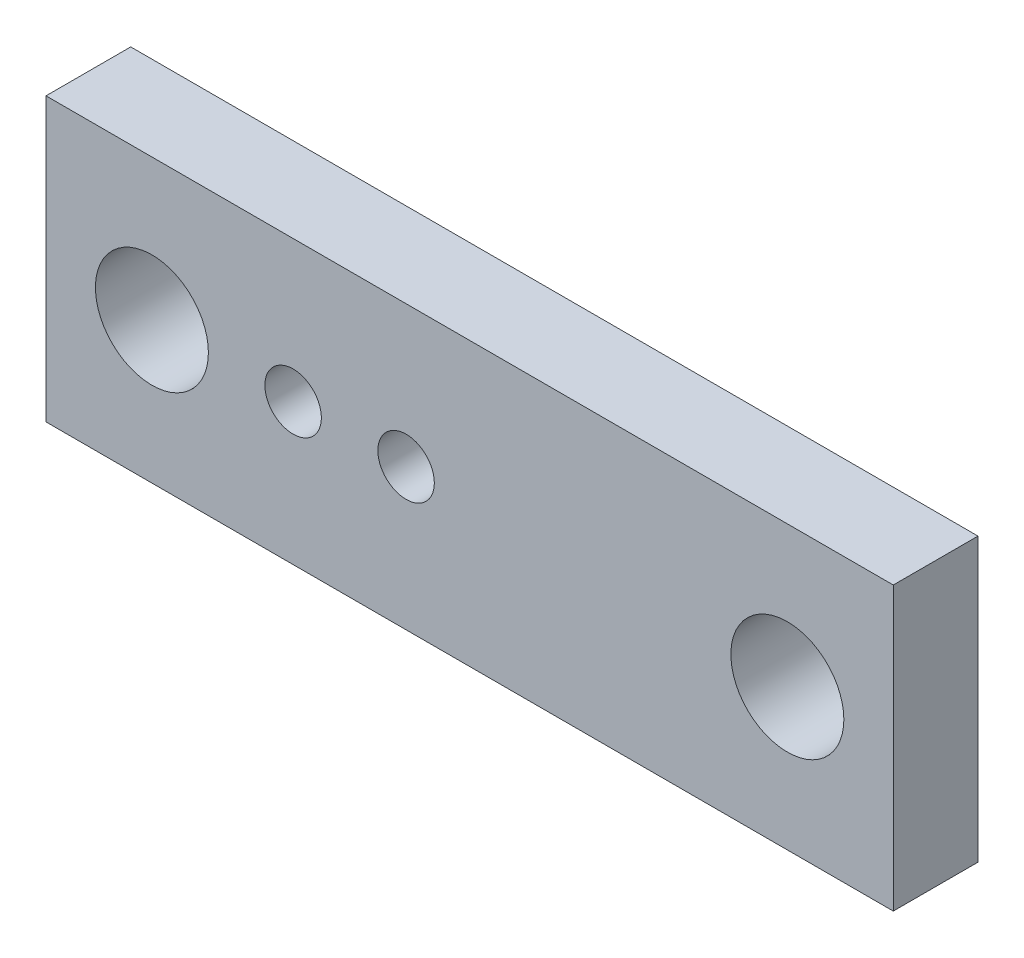
ISO-10303-21;
HEADER;
FILE_DESCRIPTION(('STEP AP214'),'2;1');
FILE_NAME('part.step','',(''),(''),'','','');
FILE_SCHEMA(('AUTOMOTIVE_DESIGN { 1 0 10303 214 1 1 1 1 }'));
ENDSEC;
DATA;
#1=APPLICATION_CONTEXT('core data for automotive mechanical design processes');
#2=APPLICATION_PROTOCOL_DEFINITION('international standard','automotive_design',2000,#1);
#3=PRODUCT_CONTEXT('',#1,'mechanical');
#4=PRODUCT('Part','Part','',(#3));
#5=PRODUCT_RELATED_PRODUCT_CATEGORY('part','',(#4));
#6=PRODUCT_DEFINITION_FORMATION('','',#4);
#7=PRODUCT_DEFINITION_CONTEXT('part definition',#1,'design');
#8=PRODUCT_DEFINITION('design','',#6,#7);
#9=PRODUCT_DEFINITION_SHAPE('','',#8);
#10=(LENGTH_UNIT() NAMED_UNIT(*) SI_UNIT(.MILLI.,.METRE.));
#11=(NAMED_UNIT(*) PLANE_ANGLE_UNIT() SI_UNIT($,.RADIAN.));
#12=(NAMED_UNIT(*) SI_UNIT($,.STERADIAN.) SOLID_ANGLE_UNIT());
#13=UNCERTAINTY_MEASURE_WITH_UNIT(LENGTH_MEASURE(1.E-05),#10,'distance_accuracy_value','');
#14=(GEOMETRIC_REPRESENTATION_CONTEXT(3) GLOBAL_UNCERTAINTY_ASSIGNED_CONTEXT((#13)) GLOBAL_UNIT_ASSIGNED_CONTEXT((#10,
#11,#12)) REPRESENTATION_CONTEXT('',''));
#15=CARTESIAN_POINT('',(0.,0.,0.));
#16=DIRECTION('',(0.,0.,1.));
#17=DIRECTION('',(1.,0.,0.));
#18=AXIS2_PLACEMENT_3D('',#15,#16,#17);
#19=CARTESIAN_POINT('',(17.5,10.,6.));
#20=DIRECTION('',(0.,0.,-1.));
#21=DIRECTION('',(-1.,0.,0.));
#22=AXIS2_PLACEMENT_3D('',#19,#20,#21);
#23=CYLINDRICAL_SURFACE('',#22,2.);
#24=CARTESIAN_POINT('',(17.5,10.,6.));
#25=DIRECTION('',(0.,0.,1.));
#26=DIRECTION('',(1.,0.,0.));
#27=AXIS2_PLACEMENT_3D('',#24,#25,#26);
#28=CIRCLE('',#27,2.);
#29=CARTESIAN_POINT('',(19.5,10.,6.));
#30=VERTEX_POINT('',#29);
#31=EDGE_CURVE('E158',#30,#30,#28,.T.);
#32=ORIENTED_EDGE('',*,*,#31,.T.);
#33=EDGE_LOOP('',(#32));
#34=FACE_BOUND('',#33,.T.);
#35=CARTESIAN_POINT('',(17.5,10.,3.));
#36=DIRECTION('',(0.,0.,-1.));
#37=DIRECTION('',(-1.,0.,0.));
#38=AXIS2_PLACEMENT_3D('',#35,#36,#37);
#39=CIRCLE('',#38,2.);
#40=CARTESIAN_POINT('',(15.5,10.,3.));
#41=VERTEX_POINT('',#40);
#42=EDGE_CURVE('E147',#41,#41,#39,.T.);
#43=ORIENTED_EDGE('',*,*,#42,.T.);
#44=EDGE_LOOP('',(#43));
#45=FACE_BOUND('',#44,.T.);
#46=ADVANCED_FACE('F35',(#34,#45),#23,.F.);
#47=CARTESIAN_POINT('',(25.5,10.,6.));
#48=DIRECTION('',(0.,0.,-1.));
#49=DIRECTION('',(-1.,0.,0.));
#50=AXIS2_PLACEMENT_3D('',#47,#48,#49);
#51=CYLINDRICAL_SURFACE('',#50,2.);
#52=CARTESIAN_POINT('',(25.5,10.,6.));
#53=DIRECTION('',(0.,0.,1.));
#54=DIRECTION('',(1.,0.,0.));
#55=AXIS2_PLACEMENT_3D('',#52,#53,#54);
#56=CIRCLE('',#55,2.);
#57=CARTESIAN_POINT('',(27.5,10.,6.));
#58=VERTEX_POINT('',#57);
#59=EDGE_CURVE('E154',#58,#58,#56,.T.);
#60=ORIENTED_EDGE('',*,*,#59,.T.);
#61=EDGE_LOOP('',(#60));
#62=FACE_BOUND('',#61,.T.);
#63=CARTESIAN_POINT('',(25.5,10.,3.));
#64=DIRECTION('',(0.,0.,-1.));
#65=DIRECTION('',(-1.,0.,0.));
#66=AXIS2_PLACEMENT_3D('',#63,#64,#65);
#67=CIRCLE('',#66,2.);
#68=CARTESIAN_POINT('',(23.5,10.,3.));
#69=VERTEX_POINT('',#68);
#70=EDGE_CURVE('E39',#69,#69,#67,.T.);
#71=ORIENTED_EDGE('',*,*,#70,.T.);
#72=EDGE_LOOP('',(#71));
#73=FACE_BOUND('',#72,.T.);
#74=ADVANCED_FACE('F204',(#62,#73),#51,.F.);
#75=CARTESIAN_POINT('',(0.,0.,6.));
#76=DIRECTION('',(0.,1.,0.));
#77=DIRECTION('',(0.,0.,1.));
#78=AXIS2_PLACEMENT_3D('',#75,#76,#77);
#79=PLANE('',#78);
#80=DIRECTION('',(1.,0.,0.));
#81=VECTOR('',#80,1.);
#82=CARTESIAN_POINT('',(0.,0.,0.));
#83=LINE('',#82,#81);
#84=CARTESIAN_POINT('',(0.,0.,0.));
#85=VERTEX_POINT('',#84);
#86=CARTESIAN_POINT('',(60.,0.,0.));
#87=VERTEX_POINT('',#86);
#88=EDGE_CURVE('E177',#85,#87,#83,.T.);
#89=ORIENTED_EDGE('',*,*,#88,.T.);
#90=DIRECTION('',(0.,0.,-1.));
#91=VECTOR('',#90,1.);
#92=CARTESIAN_POINT('',(60.,0.,6.));
#93=LINE('',#92,#91);
#94=CARTESIAN_POINT('',(60.,0.,6.));
#95=VERTEX_POINT('',#94);
#96=EDGE_CURVE('E11',#95,#87,#93,.T.);
#97=ORIENTED_EDGE('',*,*,#96,.F.);
#98=DIRECTION('',(1.,0.,0.));
#99=VECTOR('',#98,1.);
#100=CARTESIAN_POINT('',(0.,0.,6.));
#101=LINE('',#100,#99);
#102=CARTESIAN_POINT('',(0.,0.,6.));
#103=VERTEX_POINT('',#102);
#104=EDGE_CURVE('E164',#103,#95,#101,.T.);
#105=ORIENTED_EDGE('',*,*,#104,.F.);
#106=DIRECTION('',(0.,0.,-1.));
#107=VECTOR('',#106,1.);
#108=CARTESIAN_POINT('',(0.,0.,6.));
#109=LINE('',#108,#107);
#110=EDGE_CURVE('E60',#103,#85,#109,.T.);
#111=ORIENTED_EDGE('',*,*,#110,.T.);
#112=EDGE_LOOP('',(#89,#97,#105,#111));
#113=FACE_BOUND('',#112,.T.);
#114=ADVANCED_FACE('F202',(#113),#79,.F.);
#115=CARTESIAN_POINT('',(60.,0.,6.));
#116=DIRECTION('',(-1.,0.,0.));
#117=DIRECTION('',(0.,0.,1.));
#118=AXIS2_PLACEMENT_3D('',#115,#116,#117);
#119=PLANE('',#118);
#120=DIRECTION('',(0.,1.,0.));
#121=VECTOR('',#120,1.);
#122=CARTESIAN_POINT('',(60.,0.,0.));
#123=LINE('',#122,#121);
#124=CARTESIAN_POINT('',(60.,20.,0.));
#125=VERTEX_POINT('',#124);
#126=EDGE_CURVE('E179',#87,#125,#123,.T.);
#127=ORIENTED_EDGE('',*,*,#126,.T.);
#128=DIRECTION('',(0.,0.,-1.));
#129=VECTOR('',#128,1.);
#130=CARTESIAN_POINT('',(60.,20.,6.));
#131=LINE('',#130,#129);
#132=CARTESIAN_POINT('',(60.,20.,6.));
#133=VERTEX_POINT('',#132);
#134=EDGE_CURVE('E44',#133,#125,#131,.T.);
#135=ORIENTED_EDGE('',*,*,#134,.F.);
#136=DIRECTION('',(0.,1.,0.));
#137=VECTOR('',#136,1.);
#138=CARTESIAN_POINT('',(60.,0.,6.));
#139=LINE('',#138,#137);
#140=EDGE_CURVE('E86',#95,#133,#139,.T.);
#141=ORIENTED_EDGE('',*,*,#140,.F.);
#142=ORIENTED_EDGE('',*,*,#96,.T.);
#143=EDGE_LOOP('',(#127,#135,#141,#142));
#144=FACE_BOUND('',#143,.T.);
#145=ADVANCED_FACE('F194',(#144),#119,.F.);
#146=CARTESIAN_POINT('',(0.,20.,6.));
#147=DIRECTION('',(0.,1.,0.));
#148=DIRECTION('',(0.,0.,1.));
#149=AXIS2_PLACEMENT_3D('',#146,#147,#148);
#150=PLANE('',#149);
#151=DIRECTION('',(1.,0.,0.));
#152=VECTOR('',#151,1.);
#153=CARTESIAN_POINT('',(0.,20.,0.));
#154=LINE('',#153,#152);
#155=CARTESIAN_POINT('',(0.,20.,0.));
#156=VERTEX_POINT('',#155);
#157=EDGE_CURVE('E182',#156,#125,#154,.T.);
#158=ORIENTED_EDGE('',*,*,#157,.F.);
#159=DIRECTION('',(0.,0.,-1.));
#160=VECTOR('',#159,1.);
#161=CARTESIAN_POINT('',(0.,20.,6.));
#162=LINE('',#161,#160);
#163=CARTESIAN_POINT('',(0.,20.,6.));
#164=VERTEX_POINT('',#163);
#165=EDGE_CURVE('E188',#164,#156,#162,.T.);
#166=ORIENTED_EDGE('',*,*,#165,.F.);
#167=DIRECTION('',(1.,0.,0.));
#168=VECTOR('',#167,1.);
#169=CARTESIAN_POINT('',(0.,20.,6.));
#170=LINE('',#169,#168);
#171=EDGE_CURVE('E167',#164,#133,#170,.T.);
#172=ORIENTED_EDGE('',*,*,#171,.T.);
#173=ORIENTED_EDGE('',*,*,#134,.T.);
#174=EDGE_LOOP('',(#158,#166,#172,#173));
#175=FACE_BOUND('',#174,.T.);
#176=ADVANCED_FACE('F192',(#175),#150,.T.);
#177=CARTESIAN_POINT('',(7.5,10.,6.));
#178=DIRECTION('',(0.,0.,-1.));
#179=DIRECTION('',(-1.,0.,0.));
#180=AXIS2_PLACEMENT_3D('',#177,#178,#179);
#181=CYLINDRICAL_SURFACE('',#180,4.);
#182=CARTESIAN_POINT('',(7.5,10.,6.));
#183=DIRECTION('',(0.,0.,1.));
#184=DIRECTION('',(1.,0.,0.));
#185=AXIS2_PLACEMENT_3D('',#182,#183,#184);
#186=CIRCLE('',#185,4.);
#187=CARTESIAN_POINT('',(11.5,10.,6.));
#188=VERTEX_POINT('',#187);
#189=EDGE_CURVE('E161',#188,#188,#186,.T.);
#190=ORIENTED_EDGE('',*,*,#189,.T.);
#191=EDGE_LOOP('',(#190));
#192=FACE_BOUND('',#191,.T.);
#193=CARTESIAN_POINT('',(7.5,10.,0.));
#194=DIRECTION('',(0.,0.,1.));
#195=DIRECTION('',(1.,0.,0.));
#196=AXIS2_PLACEMENT_3D('',#193,#194,#195);
#197=CIRCLE('',#196,4.);
#198=CARTESIAN_POINT('',(11.5,10.,0.));
#199=VERTEX_POINT('',#198);
#200=EDGE_CURVE('E174',#199,#199,#197,.T.);
#201=ORIENTED_EDGE('',*,*,#200,.F.);
#202=EDGE_LOOP('',(#201));
#203=FACE_BOUND('',#202,.T.);
#204=ADVANCED_FACE('F219',(#192,#203),#181,.F.);
#205=CARTESIAN_POINT('',(52.5,10.,6.));
#206=DIRECTION('',(0.,0.,-1.));
#207=DIRECTION('',(-1.,0.,0.));
#208=AXIS2_PLACEMENT_3D('',#205,#206,#207);
#209=CYLINDRICAL_SURFACE('',#208,4.00000000000001);
#210=CARTESIAN_POINT('',(52.5,10.,6.));
#211=DIRECTION('',(0.,0.,1.));
#212=DIRECTION('',(1.,0.,0.));
#213=AXIS2_PLACEMENT_3D('',#210,#211,#212);
#214=CIRCLE('',#213,4.00000000000001);
#215=CARTESIAN_POINT('',(56.5,10.,6.));
#216=VERTEX_POINT('',#215);
#217=EDGE_CURVE('E151',#216,#216,#214,.T.);
#218=ORIENTED_EDGE('',*,*,#217,.T.);
#219=EDGE_LOOP('',(#218));
#220=FACE_BOUND('',#219,.T.);
#221=CARTESIAN_POINT('',(52.5,10.,0.));
#222=DIRECTION('',(0.,0.,1.));
#223=DIRECTION('',(1.,0.,0.));
#224=AXIS2_PLACEMENT_3D('',#221,#222,#223);
#225=CIRCLE('',#224,4.00000000000001);
#226=CARTESIAN_POINT('',(56.5,10.,0.));
#227=VERTEX_POINT('',#226);
#228=EDGE_CURVE('E150',#227,#227,#225,.T.);
#229=ORIENTED_EDGE('',*,*,#228,.F.);
#230=EDGE_LOOP('',(#229));
#231=FACE_BOUND('',#230,.T.);
#232=ADVANCED_FACE('F37',(#220,#231),#209,.F.);
#233=CARTESIAN_POINT('',(0.,0.,6.));
#234=DIRECTION('',(-1.,0.,0.));
#235=DIRECTION('',(0.,0.,1.));
#236=AXIS2_PLACEMENT_3D('',#233,#234,#235);
#237=PLANE('',#236);
#238=DIRECTION('',(0.,1.,0.));
#239=VECTOR('',#238,1.);
#240=CARTESIAN_POINT('',(0.,0.,0.));
#241=LINE('',#240,#239);
#242=EDGE_CURVE('E155',#85,#156,#241,.T.);
#243=ORIENTED_EDGE('',*,*,#242,.F.);
#244=ORIENTED_EDGE('',*,*,#110,.F.);
#245=DIRECTION('',(0.,1.,0.));
#246=VECTOR('',#245,1.);
#247=CARTESIAN_POINT('',(0.,0.,6.));
#248=LINE('',#247,#246);
#249=EDGE_CURVE('E170',#103,#164,#248,.T.);
#250=ORIENTED_EDGE('',*,*,#249,.T.);
#251=ORIENTED_EDGE('',*,*,#165,.T.);
#252=EDGE_LOOP('',(#243,#244,#250,#251));
#253=FACE_BOUND('',#252,.T.);
#254=ADVANCED_FACE('F198',(#253),#237,.T.);
#255=CARTESIAN_POINT('',(0.,0.,6.));
#256=DIRECTION('',(0.,0.,1.));
#257=DIRECTION('',(1.,0.,0.));
#258=AXIS2_PLACEMENT_3D('',#255,#256,#257);
#259=PLANE('',#258);
#260=ORIENTED_EDGE('',*,*,#217,.F.);
#261=EDGE_LOOP('',(#260));
#262=FACE_BOUND('',#261,.T.);
#263=ORIENTED_EDGE('',*,*,#59,.F.);
#264=EDGE_LOOP('',(#263));
#265=FACE_BOUND('',#264,.T.);
#266=ORIENTED_EDGE('',*,*,#31,.F.);
#267=EDGE_LOOP('',(#266));
#268=FACE_BOUND('',#267,.T.);
#269=ORIENTED_EDGE('',*,*,#189,.F.);
#270=EDGE_LOOP('',(#269));
#271=FACE_BOUND('',#270,.T.);
#272=ORIENTED_EDGE('',*,*,#104,.T.);
#273=ORIENTED_EDGE('',*,*,#140,.T.);
#274=ORIENTED_EDGE('',*,*,#171,.F.);
#275=ORIENTED_EDGE('',*,*,#249,.F.);
#276=EDGE_LOOP('',(#272,#273,#274,#275));
#277=FACE_BOUND('',#276,.T.);
#278=ADVANCED_FACE('F201',(#262,#265,#268,#271,#277),#259,.T.);
#279=CARTESIAN_POINT('',(0.,0.,0.));
#280=DIRECTION('',(0.,0.,1.));
#281=DIRECTION('',(1.,0.,0.));
#282=AXIS2_PLACEMENT_3D('',#279,#280,#281);
#283=PLANE('',#282);
#284=DIRECTION('',(-1.,0.,0.));
#285=VECTOR('',#284,1.);
#286=CARTESIAN_POINT('',(25.5,7.25,0.));
#287=LINE('',#286,#285);
#288=CARTESIAN_POINT('',(25.5,7.25,0.));
#289=VERTEX_POINT('',#288);
#290=CARTESIAN_POINT('',(17.5,7.25,0.));
#291=VERTEX_POINT('',#290);
#292=EDGE_CURVE('E138',#289,#291,#287,.T.);
#293=ORIENTED_EDGE('',*,*,#292,.F.);
#294=CARTESIAN_POINT('',(25.5,10.,0.));
#295=DIRECTION('',(0.,0.,-1.));
#296=DIRECTION('',(-1.,0.,0.));
#297=AXIS2_PLACEMENT_3D('',#294,#295,#296);
#298=CIRCLE('',#297,2.75);
#299=CARTESIAN_POINT('',(25.5,12.75,0.));
#300=VERTEX_POINT('',#299);
#301=EDGE_CURVE('E51',#300,#289,#298,.T.);
#302=ORIENTED_EDGE('',*,*,#301,.F.);
#303=DIRECTION('',(1.,0.,0.));
#304=VECTOR('',#303,1.);
#305=CARTESIAN_POINT('',(25.5,12.75,0.));
#306=LINE('',#305,#304);
#307=CARTESIAN_POINT('',(17.5,12.75,0.));
#308=VERTEX_POINT('',#307);
#309=EDGE_CURVE('E129',#308,#300,#306,.T.);
#310=ORIENTED_EDGE('',*,*,#309,.F.);
#311=CARTESIAN_POINT('',(17.5,10.,0.));
#312=DIRECTION('',(0.,0.,-1.));
#313=DIRECTION('',(-1.,0.,0.));
#314=AXIS2_PLACEMENT_3D('',#311,#312,#313);
#315=CIRCLE('',#314,2.75);
#316=EDGE_CURVE('E132',#291,#308,#315,.T.);
#317=ORIENTED_EDGE('',*,*,#316,.F.);
#318=EDGE_LOOP('',(#293,#302,#310,#317));
#319=FACE_BOUND('',#318,.T.);
#320=ORIENTED_EDGE('',*,*,#228,.T.);
#321=EDGE_LOOP('',(#320));
#322=FACE_BOUND('',#321,.T.);
#323=ORIENTED_EDGE('',*,*,#200,.T.);
#324=EDGE_LOOP('',(#323));
#325=FACE_BOUND('',#324,.T.);
#326=ORIENTED_EDGE('',*,*,#88,.F.);
#327=ORIENTED_EDGE('',*,*,#242,.T.);
#328=ORIENTED_EDGE('',*,*,#157,.T.);
#329=ORIENTED_EDGE('',*,*,#126,.F.);
#330=EDGE_LOOP('',(#326,#327,#328,#329));
#331=FACE_BOUND('',#330,.T.);
#332=ADVANCED_FACE('F197',(#319,#322,#325,#331),#283,.F.);
#333=CARTESIAN_POINT('',(25.5,10.,3.));
#334=DIRECTION('',(0.,0.,-1.));
#335=DIRECTION('',(-1.,0.,0.));
#336=AXIS2_PLACEMENT_3D('',#333,#334,#335);
#337=CYLINDRICAL_SURFACE('',#336,2.75);
#338=ORIENTED_EDGE('',*,*,#301,.T.);
#339=DIRECTION('',(0.,0.,-1.));
#340=VECTOR('',#339,1.);
#341=CARTESIAN_POINT('',(25.5,7.25,3.));
#342=LINE('',#341,#340);
#343=CARTESIAN_POINT('',(25.5,7.25,3.));
#344=VERTEX_POINT('',#343);
#345=EDGE_CURVE('E107',#344,#289,#342,.T.);
#346=ORIENTED_EDGE('',*,*,#345,.F.);
#347=CARTESIAN_POINT('',(25.5,10.,3.));
#348=DIRECTION('',(0.,0.,-1.));
#349=DIRECTION('',(-1.,0.,0.));
#350=AXIS2_PLACEMENT_3D('',#347,#348,#349);
#351=CIRCLE('',#350,2.75);
#352=CARTESIAN_POINT('',(25.5,12.75,3.));
#353=VERTEX_POINT('',#352);
#354=EDGE_CURVE('E111',#353,#344,#351,.T.);
#355=ORIENTED_EDGE('',*,*,#354,.F.);
#356=DIRECTION('',(0.,0.,-1.));
#357=VECTOR('',#356,1.);
#358=CARTESIAN_POINT('',(25.5,12.75,3.));
#359=LINE('',#358,#357);
#360=EDGE_CURVE('E142',#353,#300,#359,.T.);
#361=ORIENTED_EDGE('',*,*,#360,.T.);
#362=EDGE_LOOP('',(#338,#346,#355,#361));
#363=FACE_BOUND('',#362,.T.);
#364=ADVANCED_FACE('F109',(#363),#337,.F.);
#365=CARTESIAN_POINT('',(25.5,12.75,3.));
#366=DIRECTION('',(0.,1.,0.));
#367=DIRECTION('',(0.,0.,1.));
#368=AXIS2_PLACEMENT_3D('',#365,#366,#367);
#369=PLANE('',#368);
#370=ORIENTED_EDGE('',*,*,#309,.T.);
#371=ORIENTED_EDGE('',*,*,#360,.F.);
#372=DIRECTION('',(1.,0.,0.));
#373=VECTOR('',#372,1.);
#374=CARTESIAN_POINT('',(25.5,12.75,3.));
#375=LINE('',#374,#373);
#376=CARTESIAN_POINT('',(17.5,12.75,3.));
#377=VERTEX_POINT('',#376);
#378=EDGE_CURVE('E117',#377,#353,#375,.T.);
#379=ORIENTED_EDGE('',*,*,#378,.F.);
#380=DIRECTION('',(0.,0.,-1.));
#381=VECTOR('',#380,1.);
#382=CARTESIAN_POINT('',(17.5,12.75,3.));
#383=LINE('',#382,#381);
#384=EDGE_CURVE('E144',#377,#308,#383,.T.);
#385=ORIENTED_EDGE('',*,*,#384,.T.);
#386=EDGE_LOOP('',(#370,#371,#379,#385));
#387=FACE_BOUND('',#386,.T.);
#388=ADVANCED_FACE('F239',(#387),#369,.F.);
#389=CARTESIAN_POINT('',(17.5,10.,3.));
#390=DIRECTION('',(0.,0.,-1.));
#391=DIRECTION('',(-1.,0.,0.));
#392=AXIS2_PLACEMENT_3D('',#389,#390,#391);
#393=CYLINDRICAL_SURFACE('',#392,2.75);
#394=ORIENTED_EDGE('',*,*,#316,.T.);
#395=ORIENTED_EDGE('',*,*,#384,.F.);
#396=CARTESIAN_POINT('',(17.5,10.,3.));
#397=DIRECTION('',(0.,0.,-1.));
#398=DIRECTION('',(-1.,0.,0.));
#399=AXIS2_PLACEMENT_3D('',#396,#397,#398);
#400=CIRCLE('',#399,2.75);
#401=CARTESIAN_POINT('',(17.5,7.25,3.));
#402=VERTEX_POINT('',#401);
#403=EDGE_CURVE('E125',#402,#377,#400,.T.);
#404=ORIENTED_EDGE('',*,*,#403,.F.);
#405=DIRECTION('',(0.,0.,-1.));
#406=VECTOR('',#405,1.);
#407=CARTESIAN_POINT('',(17.5,7.25,3.));
#408=LINE('',#407,#406);
#409=EDGE_CURVE('E116',#402,#291,#408,.T.);
#410=ORIENTED_EDGE('',*,*,#409,.T.);
#411=EDGE_LOOP('',(#394,#395,#404,#410));
#412=FACE_BOUND('',#411,.T.);
#413=ADVANCED_FACE('F285',(#412),#393,.F.);
#414=CARTESIAN_POINT('',(25.5,7.25,3.));
#415=DIRECTION('',(0.,-1.,0.));
#416=DIRECTION('',(0.,0.,-1.));
#417=AXIS2_PLACEMENT_3D('',#414,#415,#416);
#418=PLANE('',#417);
#419=ORIENTED_EDGE('',*,*,#292,.T.);
#420=ORIENTED_EDGE('',*,*,#409,.F.);
#421=DIRECTION('',(-1.,0.,0.));
#422=VECTOR('',#421,1.);
#423=CARTESIAN_POINT('',(25.5,7.25,3.));
#424=LINE('',#423,#422);
#425=EDGE_CURVE('E120',#344,#402,#424,.T.);
#426=ORIENTED_EDGE('',*,*,#425,.F.);
#427=ORIENTED_EDGE('',*,*,#345,.T.);
#428=EDGE_LOOP('',(#419,#420,#426,#427));
#429=FACE_BOUND('',#428,.T.);
#430=ADVANCED_FACE('F121',(#429),#418,.F.);
#431=CARTESIAN_POINT('',(25.5,10.,3.));
#432=DIRECTION('',(0.,0.,-1.));
#433=DIRECTION('',(-1.,0.,0.));
#434=AXIS2_PLACEMENT_3D('',#431,#432,#433);
#435=PLANE('',#434);
#436=ORIENTED_EDGE('',*,*,#42,.F.);
#437=EDGE_LOOP('',(#436));
#438=FACE_BOUND('',#437,.T.);
#439=ORIENTED_EDGE('',*,*,#70,.F.);
#440=EDGE_LOOP('',(#439));
#441=FACE_BOUND('',#440,.T.);
#442=ORIENTED_EDGE('',*,*,#354,.T.);
#443=ORIENTED_EDGE('',*,*,#425,.T.);
#444=ORIENTED_EDGE('',*,*,#403,.T.);
#445=ORIENTED_EDGE('',*,*,#378,.T.);
#446=EDGE_LOOP('',(#442,#443,#444,#445));
#447=FACE_BOUND('',#446,.T.);
#448=ADVANCED_FACE('F127',(#438,#441,#447),#435,.T.);
#449=CLOSED_SHELL('',(#46,#74,#114,#145,#176,#204,#232,#254,#278,#332,#364,#388,#413,#430,#448));
#450=MANIFOLD_SOLID_BREP('B2',#449);
#451=ADVANCED_BREP_SHAPE_REPRESENTATION('',(#18,#450),#14);
#452=SHAPE_DEFINITION_REPRESENTATION(#9,#451);
ENDSEC;
END-ISO-10303-21;
